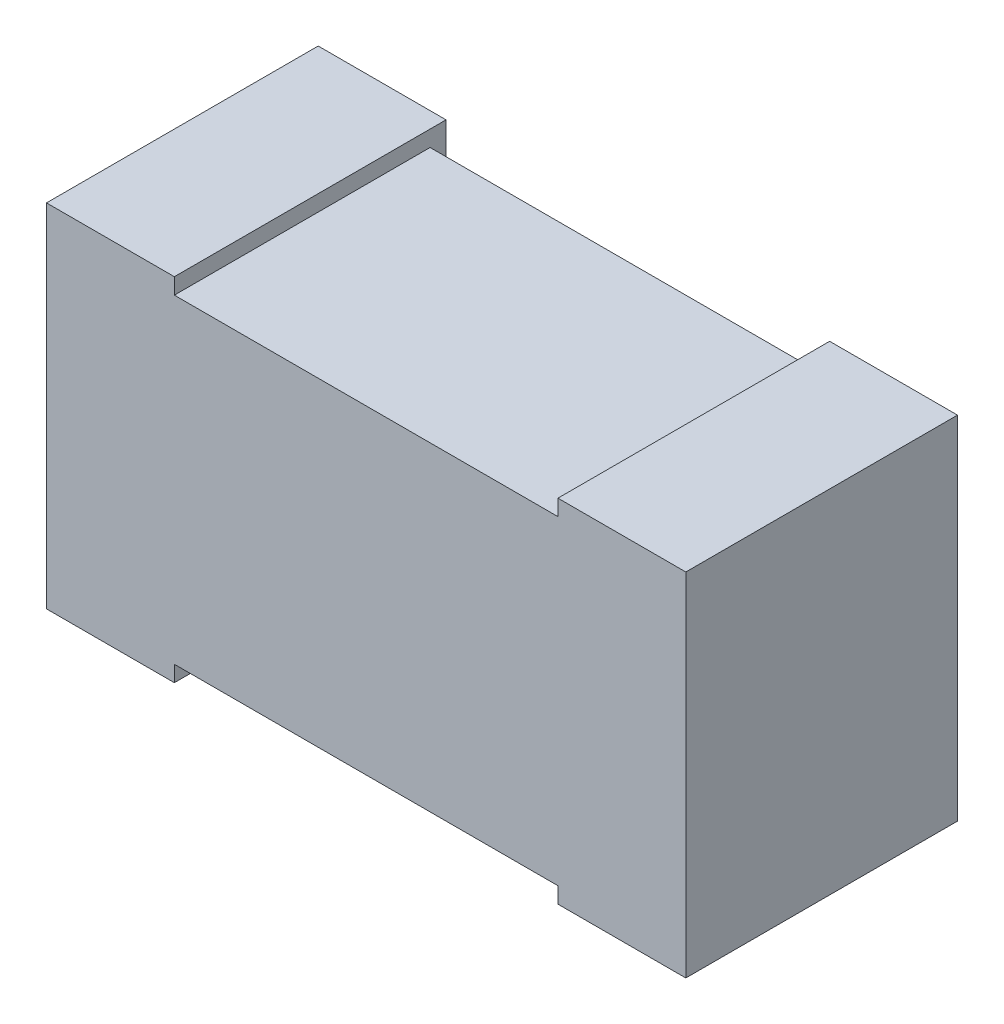
ISO-10303-21;
HEADER;
FILE_DESCRIPTION(('STEP AP214'),'2;1');
FILE_NAME('part.step','',(''),(''),'','','');
FILE_SCHEMA(('AUTOMOTIVE_DESIGN { 1 0 10303 214 1 1 1 1 }'));
ENDSEC;
DATA;
#1=APPLICATION_CONTEXT('core data for automotive mechanical design processes');
#2=APPLICATION_PROTOCOL_DEFINITION('international standard','automotive_design',2000,#1);
#3=PRODUCT_CONTEXT('',#1,'mechanical');
#4=PRODUCT('Part','Part','',(#3));
#5=PRODUCT_RELATED_PRODUCT_CATEGORY('part','',(#4));
#6=PRODUCT_DEFINITION_FORMATION('','',#4);
#7=PRODUCT_DEFINITION_CONTEXT('part definition',#1,'design');
#8=PRODUCT_DEFINITION('design','',#6,#7);
#9=PRODUCT_DEFINITION_SHAPE('','',#8);
#10=(LENGTH_UNIT() NAMED_UNIT(*) SI_UNIT(.MILLI.,.METRE.));
#11=(NAMED_UNIT(*) PLANE_ANGLE_UNIT() SI_UNIT($,.RADIAN.));
#12=(NAMED_UNIT(*) SI_UNIT($,.STERADIAN.) SOLID_ANGLE_UNIT());
#13=UNCERTAINTY_MEASURE_WITH_UNIT(LENGTH_MEASURE(1.E-05),#10,'distance_accuracy_value','');
#14=(GEOMETRIC_REPRESENTATION_CONTEXT(3) GLOBAL_UNCERTAINTY_ASSIGNED_CONTEXT((#13)) GLOBAL_UNIT_ASSIGNED_CONTEXT((#10,
#11,#12)) REPRESENTATION_CONTEXT('',''));
#15=CARTESIAN_POINT('',(0.,0.,0.));
#16=DIRECTION('',(0.,0.,1.));
#17=DIRECTION('',(1.,0.,0.));
#18=AXIS2_PLACEMENT_3D('',#15,#16,#17);
#19=CARTESIAN_POINT('',(7.999,-2.551,-7.85));
#20=DIRECTION('',(0.,0.,-1.));
#21=DIRECTION('',(0.,1.,0.));
#22=AXIS2_PLACEMENT_3D('',#19,#20,#21);
#23=PLANE('',#22);
#24=DIRECTION('',(1.,0.,0.));
#25=VECTOR('',#24,1.);
#26=CARTESIAN_POINT('',(8.2,-2.55,-7.85));
#27=LINE('',#26,#25);
#28=CARTESIAN_POINT('',(8.,-2.55,-7.85));
#29=VERTEX_POINT('',#28);
#30=CARTESIAN_POINT('',(8.4,-2.55,-7.85));
#31=VERTEX_POINT('',#30);
#32=EDGE_CURVE('E110',#29,#31,#27,.T.);
#33=ORIENTED_EDGE('',*,*,#32,.F.);
#34=DIRECTION('',(0.,-1.,0.));
#35=VECTOR('',#34,1.);
#36=CARTESIAN_POINT('',(8.,-2.,-7.85));
#37=LINE('',#36,#35);
#38=CARTESIAN_POINT('',(8.,-1.45,-7.85));
#39=VERTEX_POINT('',#38);
#40=EDGE_CURVE('E104',#39,#29,#37,.T.);
#41=ORIENTED_EDGE('',*,*,#40,.F.);
#42=DIRECTION('',(-1.,0.,0.));
#43=VECTOR('',#42,1.);
#44=CARTESIAN_POINT('',(8.2,-1.45,-7.85));
#45=LINE('',#44,#43);
#46=CARTESIAN_POINT('',(8.4,-1.45,-7.85));
#47=VERTEX_POINT('',#46);
#48=EDGE_CURVE('E21',#47,#39,#45,.T.);
#49=ORIENTED_EDGE('',*,*,#48,.F.);
#50=DIRECTION('',(0.,1.,0.));
#51=VECTOR('',#50,1.);
#52=CARTESIAN_POINT('',(8.4,-2.,-7.85));
#53=LINE('',#52,#51);
#54=EDGE_CURVE('E131',#31,#47,#53,.T.);
#55=ORIENTED_EDGE('',*,*,#54,.F.);
#56=EDGE_LOOP('',(#33,#41,#49,#55));
#57=FACE_BOUND('',#56,.T.);
#58=ADVANCED_FACE('F17',(#57),#23,.T.);
#59=CARTESIAN_POINT('',(7.999,-1.45,-6.999));
#60=DIRECTION('',(0.,1.,0.));
#61=DIRECTION('',(1.,0.,0.));
#62=AXIS2_PLACEMENT_3D('',#59,#60,#61);
#63=PLANE('',#62);
#64=DIRECTION('',(0.,0.,1.));
#65=VECTOR('',#64,1.);
#66=CARTESIAN_POINT('',(8.4,-1.45,-7.425));
#67=LINE('',#66,#65);
#68=CARTESIAN_POINT('',(8.4,-1.45,-7.));
#69=VERTEX_POINT('',#68);
#70=EDGE_CURVE('E117',#47,#69,#67,.T.);
#71=ORIENTED_EDGE('',*,*,#70,.F.);
#72=ORIENTED_EDGE('',*,*,#48,.T.);
#73=DIRECTION('',(0.,0.,-1.));
#74=VECTOR('',#73,1.);
#75=CARTESIAN_POINT('',(8.,-1.45,-7.425));
#76=LINE('',#75,#74);
#77=CARTESIAN_POINT('',(8.,-1.45,-7.));
#78=VERTEX_POINT('',#77);
#79=EDGE_CURVE('E112',#78,#39,#76,.T.);
#80=ORIENTED_EDGE('',*,*,#79,.F.);
#81=DIRECTION('',(-1.,0.,0.));
#82=VECTOR('',#81,1.);
#83=CARTESIAN_POINT('',(9.,-1.45,-7.));
#84=LINE('',#83,#82);
#85=EDGE_CURVE('E155',#69,#78,#84,.T.);
#86=ORIENTED_EDGE('',*,*,#85,.F.);
#87=EDGE_LOOP('',(#71,#72,#80,#86));
#88=FACE_BOUND('',#87,.T.);
#89=ADVANCED_FACE('F114',(#88),#63,.T.);
#90=CARTESIAN_POINT('',(8.,-2.551,-6.999));
#91=DIRECTION('',(-1.,0.,0.));
#92=DIRECTION('',(0.,1.,0.));
#93=AXIS2_PLACEMENT_3D('',#90,#91,#92);
#94=PLANE('',#93);
#95=DIRECTION('',(0.,-1.,0.));
#96=VECTOR('',#95,1.);
#97=CARTESIAN_POINT('',(8.,-2.,-7.));
#98=LINE('',#97,#96);
#99=CARTESIAN_POINT('',(8.,-2.55,-7.));
#100=VERTEX_POINT('',#99);
#101=EDGE_CURVE('E121',#78,#100,#98,.T.);
#102=ORIENTED_EDGE('',*,*,#101,.F.);
#103=ORIENTED_EDGE('',*,*,#79,.T.);
#104=ORIENTED_EDGE('',*,*,#40,.T.);
#105=DIRECTION('',(0.,0.,-1.));
#106=VECTOR('',#105,1.);
#107=CARTESIAN_POINT('',(8.,-2.55,-7.425));
#108=LINE('',#107,#106);
#109=EDGE_CURVE('E123',#100,#29,#108,.T.);
#110=ORIENTED_EDGE('',*,*,#109,.F.);
#111=EDGE_LOOP('',(#102,#103,#104,#110));
#112=FACE_BOUND('',#111,.T.);
#113=ADVANCED_FACE('F119',(#112),#94,.T.);
#114=CARTESIAN_POINT('',(8.401,-2.55,-6.999));
#115=DIRECTION('',(0.,-1.,0.));
#116=DIRECTION('',(-1.,0.,0.));
#117=AXIS2_PLACEMENT_3D('',#114,#115,#116);
#118=PLANE('',#117);
#119=ORIENTED_EDGE('',*,*,#109,.T.);
#120=ORIENTED_EDGE('',*,*,#32,.T.);
#121=DIRECTION('',(0.,0.,-1.));
#122=VECTOR('',#121,1.);
#123=CARTESIAN_POINT('',(8.4,-2.55,-7.425));
#124=LINE('',#123,#122);
#125=CARTESIAN_POINT('',(8.4,-2.55,-7.));
#126=VERTEX_POINT('',#125);
#127=EDGE_CURVE('E128',#126,#31,#124,.T.);
#128=ORIENTED_EDGE('',*,*,#127,.F.);
#129=DIRECTION('',(1.,0.,0.));
#130=VECTOR('',#129,1.);
#131=CARTESIAN_POINT('',(9.,-2.55,-7.));
#132=LINE('',#131,#130);
#133=EDGE_CURVE('E158',#100,#126,#132,.T.);
#134=ORIENTED_EDGE('',*,*,#133,.F.);
#135=EDGE_LOOP('',(#119,#120,#128,#134));
#136=FACE_BOUND('',#135,.T.);
#137=ADVANCED_FACE('F228',(#136),#118,.T.);
#138=CARTESIAN_POINT('',(8.4,-1.449,-6.999));
#139=DIRECTION('',(1.,0.,0.));
#140=DIRECTION('',(0.,-1.,0.));
#141=AXIS2_PLACEMENT_3D('',#138,#139,#140);
#142=PLANE('',#141);
#143=ORIENTED_EDGE('',*,*,#70,.T.);
#144=DIRECTION('',(0.,1.,0.));
#145=VECTOR('',#144,1.);
#146=CARTESIAN_POINT('',(8.4,-2.,-7.));
#147=LINE('',#146,#145);
#148=CARTESIAN_POINT('',(8.4,-1.5,-7.));
#149=VERTEX_POINT('',#148);
#150=EDGE_CURVE('E152',#149,#69,#147,.T.);
#151=ORIENTED_EDGE('',*,*,#150,.F.);
#152=DIRECTION('',(0.,0.,1.));
#153=VECTOR('',#152,1.);
#154=CARTESIAN_POINT('',(8.4,-1.5,-7.4));
#155=LINE('',#154,#153);
#156=CARTESIAN_POINT('',(8.4,-1.5,-7.8));
#157=VERTEX_POINT('',#156);
#158=EDGE_CURVE('E142',#157,#149,#155,.T.);
#159=ORIENTED_EDGE('',*,*,#158,.F.);
#160=DIRECTION('',(0.,1.,0.));
#161=VECTOR('',#160,1.);
#162=CARTESIAN_POINT('',(8.4,-2.,-7.8));
#163=LINE('',#162,#161);
#164=CARTESIAN_POINT('',(8.4,-2.5,-7.8));
#165=VERTEX_POINT('',#164);
#166=EDGE_CURVE('E139',#165,#157,#163,.T.);
#167=ORIENTED_EDGE('',*,*,#166,.F.);
#168=DIRECTION('',(0.,0.,-1.));
#169=VECTOR('',#168,1.);
#170=CARTESIAN_POINT('',(8.4,-2.5,-7.4));
#171=LINE('',#170,#169);
#172=CARTESIAN_POINT('',(8.4,-2.5,-7.));
#173=VERTEX_POINT('',#172);
#174=EDGE_CURVE('E134',#173,#165,#171,.T.);
#175=ORIENTED_EDGE('',*,*,#174,.F.);
#176=DIRECTION('',(0.,1.,0.));
#177=VECTOR('',#176,1.);
#178=CARTESIAN_POINT('',(8.4,-2.,-7.));
#179=LINE('',#178,#177);
#180=EDGE_CURVE('E161',#126,#173,#179,.T.);
#181=ORIENTED_EDGE('',*,*,#180,.F.);
#182=ORIENTED_EDGE('',*,*,#127,.T.);
#183=ORIENTED_EDGE('',*,*,#54,.T.);
#184=EDGE_LOOP('',(#143,#151,#159,#167,#175,#181,#182,#183));
#185=FACE_BOUND('',#184,.T.);
#186=ADVANCED_FACE('F224',(#185),#142,.T.);
#187=CARTESIAN_POINT('',(9.601,-2.5,-6.999));
#188=DIRECTION('',(0.,-1.,0.));
#189=DIRECTION('',(-1.,0.,0.));
#190=AXIS2_PLACEMENT_3D('',#187,#188,#189);
#191=PLANE('',#190);
#192=ORIENTED_EDGE('',*,*,#174,.T.);
#193=DIRECTION('',(-1.,0.,0.));
#194=VECTOR('',#193,1.);
#195=CARTESIAN_POINT('',(9.,-2.5,-7.8));
#196=LINE('',#195,#194);
#197=CARTESIAN_POINT('',(9.6,-2.5,-7.8));
#198=VERTEX_POINT('',#197);
#199=EDGE_CURVE('E136',#198,#165,#196,.T.);
#200=ORIENTED_EDGE('',*,*,#199,.F.);
#201=DIRECTION('',(0.,0.,-1.));
#202=VECTOR('',#201,1.);
#203=CARTESIAN_POINT('',(9.6,-2.5,-7.425));
#204=LINE('',#203,#202);
#205=CARTESIAN_POINT('',(9.6,-2.5,-7.));
#206=VERTEX_POINT('',#205);
#207=EDGE_CURVE('E169',#206,#198,#204,.T.);
#208=ORIENTED_EDGE('',*,*,#207,.F.);
#209=DIRECTION('',(1.,0.,0.));
#210=VECTOR('',#209,1.);
#211=CARTESIAN_POINT('',(9.,-2.5,-7.));
#212=LINE('',#211,#210);
#213=EDGE_CURVE('E147',#173,#206,#212,.T.);
#214=ORIENTED_EDGE('',*,*,#213,.F.);
#215=EDGE_LOOP('',(#192,#200,#208,#214));
#216=FACE_BOUND('',#215,.T.);
#217=ADVANCED_FACE('F232',(#216),#191,.T.);
#218=CARTESIAN_POINT('',(8.399,-2.501,-7.8));
#219=DIRECTION('',(0.,0.,-1.));
#220=DIRECTION('',(0.,1.,0.));
#221=AXIS2_PLACEMENT_3D('',#218,#219,#220);
#222=PLANE('',#221);
#223=ORIENTED_EDGE('',*,*,#199,.T.);
#224=ORIENTED_EDGE('',*,*,#166,.T.);
#225=DIRECTION('',(-1.,0.,0.));
#226=VECTOR('',#225,1.);
#227=CARTESIAN_POINT('',(9.,-1.5,-7.8));
#228=LINE('',#227,#226);
#229=CARTESIAN_POINT('',(9.6,-1.5,-7.8));
#230=VERTEX_POINT('',#229);
#231=EDGE_CURVE('E144',#230,#157,#228,.T.);
#232=ORIENTED_EDGE('',*,*,#231,.F.);
#233=DIRECTION('',(0.,1.,0.));
#234=VECTOR('',#233,1.);
#235=CARTESIAN_POINT('',(9.6,-2.,-7.8));
#236=LINE('',#235,#234);
#237=EDGE_CURVE('E172',#198,#230,#236,.T.);
#238=ORIENTED_EDGE('',*,*,#237,.F.);
#239=EDGE_LOOP('',(#223,#224,#232,#238));
#240=FACE_BOUND('',#239,.T.);
#241=ADVANCED_FACE('F235',(#240),#222,.T.);
#242=CARTESIAN_POINT('',(8.399,-1.5,-6.999));
#243=DIRECTION('',(0.,1.,0.));
#244=DIRECTION('',(1.,0.,0.));
#245=AXIS2_PLACEMENT_3D('',#242,#243,#244);
#246=PLANE('',#245);
#247=DIRECTION('',(0.,0.,1.));
#248=VECTOR('',#247,1.);
#249=CARTESIAN_POINT('',(9.6,-1.5,-7.425));
#250=LINE('',#249,#248);
#251=CARTESIAN_POINT('',(9.6,-1.5,-7.));
#252=VERTEX_POINT('',#251);
#253=EDGE_CURVE('E175',#230,#252,#250,.T.);
#254=ORIENTED_EDGE('',*,*,#253,.F.);
#255=ORIENTED_EDGE('',*,*,#231,.T.);
#256=ORIENTED_EDGE('',*,*,#158,.T.);
#257=DIRECTION('',(-1.,0.,0.));
#258=VECTOR('',#257,1.);
#259=CARTESIAN_POINT('',(9.,-1.5,-7.));
#260=LINE('',#259,#258);
#261=EDGE_CURVE('E149',#252,#149,#260,.T.);
#262=ORIENTED_EDGE('',*,*,#261,.F.);
#263=EDGE_LOOP('',(#254,#255,#256,#262));
#264=FACE_BOUND('',#263,.T.);
#265=ADVANCED_FACE('F221',(#264),#246,.T.);
#266=CARTESIAN_POINT('',(7.999,-1.449,-7.));
#267=DIRECTION('',(0.,0.,1.));
#268=DIRECTION('',(0.,-1.,0.));
#269=AXIS2_PLACEMENT_3D('',#266,#267,#268);
#270=PLANE('',#269);
#271=ORIENTED_EDGE('',*,*,#133,.T.);
#272=ORIENTED_EDGE('',*,*,#180,.T.);
#273=ORIENTED_EDGE('',*,*,#213,.T.);
#274=DIRECTION('',(0.,1.,0.));
#275=VECTOR('',#274,1.);
#276=CARTESIAN_POINT('',(9.6,-2.,-7.));
#277=LINE('',#276,#275);
#278=CARTESIAN_POINT('',(9.6,-2.55,-7.));
#279=VERTEX_POINT('',#278);
#280=EDGE_CURVE('E166',#279,#206,#277,.T.);
#281=ORIENTED_EDGE('',*,*,#280,.F.);
#282=DIRECTION('',(-1.,0.,0.));
#283=VECTOR('',#282,1.);
#284=CARTESIAN_POINT('',(9.8,-2.55,-7.));
#285=LINE('',#284,#283);
#286=CARTESIAN_POINT('',(10.,-2.55,-7.));
#287=VERTEX_POINT('',#286);
#288=EDGE_CURVE('E192',#287,#279,#285,.T.);
#289=ORIENTED_EDGE('',*,*,#288,.F.);
#290=DIRECTION('',(0.,-1.,0.));
#291=VECTOR('',#290,1.);
#292=CARTESIAN_POINT('',(10.,-2.,-7.));
#293=LINE('',#292,#291);
#294=CARTESIAN_POINT('',(10.,-1.45,-7.));
#295=VERTEX_POINT('',#294);
#296=EDGE_CURVE('E186',#295,#287,#293,.T.);
#297=ORIENTED_EDGE('',*,*,#296,.F.);
#298=DIRECTION('',(1.,0.,0.));
#299=VECTOR('',#298,1.);
#300=CARTESIAN_POINT('',(9.8,-1.45,-7.));
#301=LINE('',#300,#299);
#302=CARTESIAN_POINT('',(9.6,-1.45,-7.));
#303=VERTEX_POINT('',#302);
#304=EDGE_CURVE('E181',#303,#295,#301,.T.);
#305=ORIENTED_EDGE('',*,*,#304,.F.);
#306=DIRECTION('',(0.,1.,0.));
#307=VECTOR('',#306,1.);
#308=CARTESIAN_POINT('',(9.6,-2.,-7.));
#309=LINE('',#308,#307);
#310=EDGE_CURVE('E164',#252,#303,#309,.T.);
#311=ORIENTED_EDGE('',*,*,#310,.F.);
#312=ORIENTED_EDGE('',*,*,#261,.T.);
#313=ORIENTED_EDGE('',*,*,#150,.T.);
#314=ORIENTED_EDGE('',*,*,#85,.T.);
#315=ORIENTED_EDGE('',*,*,#101,.T.);
#316=EDGE_LOOP('',(#271,#272,#273,#281,#289,#297,#305,#311,#312,#313,#314,#315));
#317=FACE_BOUND('',#316,.T.);
#318=ADVANCED_FACE('F212',(#317),#270,.T.);
#319=CARTESIAN_POINT('',(9.6,-2.551,-6.999));
#320=DIRECTION('',(-1.,0.,0.));
#321=DIRECTION('',(0.,1.,0.));
#322=AXIS2_PLACEMENT_3D('',#319,#320,#321);
#323=PLANE('',#322);
#324=ORIENTED_EDGE('',*,*,#237,.T.);
#325=ORIENTED_EDGE('',*,*,#253,.T.);
#326=ORIENTED_EDGE('',*,*,#310,.T.);
#327=DIRECTION('',(0.,0.,1.));
#328=VECTOR('',#327,1.);
#329=CARTESIAN_POINT('',(9.6,-1.45,-7.425));
#330=LINE('',#329,#328);
#331=CARTESIAN_POINT('',(9.6,-1.45,-7.85));
#332=VERTEX_POINT('',#331);
#333=EDGE_CURVE('E178',#332,#303,#330,.T.);
#334=ORIENTED_EDGE('',*,*,#333,.F.);
#335=DIRECTION('',(0.,1.,0.));
#336=VECTOR('',#335,1.);
#337=CARTESIAN_POINT('',(9.6,-2.,-7.85));
#338=LINE('',#337,#336);
#339=CARTESIAN_POINT('',(9.6,-2.55,-7.85));
#340=VERTEX_POINT('',#339);
#341=EDGE_CURVE('E195',#340,#332,#338,.T.);
#342=ORIENTED_EDGE('',*,*,#341,.F.);
#343=DIRECTION('',(0.,0.,-1.));
#344=VECTOR('',#343,1.);
#345=CARTESIAN_POINT('',(9.6,-2.55,-7.425));
#346=LINE('',#345,#344);
#347=EDGE_CURVE('E188',#279,#340,#346,.T.);
#348=ORIENTED_EDGE('',*,*,#347,.F.);
#349=ORIENTED_EDGE('',*,*,#280,.T.);
#350=ORIENTED_EDGE('',*,*,#207,.T.);
#351=EDGE_LOOP('',(#324,#325,#326,#334,#342,#348,#349,#350));
#352=FACE_BOUND('',#351,.T.);
#353=ADVANCED_FACE('F217',(#352),#323,.T.);
#354=CARTESIAN_POINT('',(9.599,-1.45,-6.999));
#355=DIRECTION('',(0.,1.,0.));
#356=DIRECTION('',(1.,0.,0.));
#357=AXIS2_PLACEMENT_3D('',#354,#355,#356);
#358=PLANE('',#357);
#359=DIRECTION('',(0.,0.,1.));
#360=VECTOR('',#359,1.);
#361=CARTESIAN_POINT('',(10.,-1.45,-7.425));
#362=LINE('',#361,#360);
#363=CARTESIAN_POINT('',(10.,-1.45,-7.85));
#364=VERTEX_POINT('',#363);
#365=EDGE_CURVE('E183',#364,#295,#362,.T.);
#366=ORIENTED_EDGE('',*,*,#365,.F.);
#367=DIRECTION('',(1.,0.,0.));
#368=VECTOR('',#367,1.);
#369=CARTESIAN_POINT('',(9.8,-1.45,-7.85));
#370=LINE('',#369,#368);
#371=EDGE_CURVE('E198',#332,#364,#370,.T.);
#372=ORIENTED_EDGE('',*,*,#371,.F.);
#373=ORIENTED_EDGE('',*,*,#333,.T.);
#374=ORIENTED_EDGE('',*,*,#304,.T.);
#375=EDGE_LOOP('',(#366,#372,#373,#374));
#376=FACE_BOUND('',#375,.T.);
#377=ADVANCED_FACE('F208',(#376),#358,.T.);
#378=CARTESIAN_POINT('',(10.,-1.449,-6.999));
#379=DIRECTION('',(1.,0.,0.));
#380=DIRECTION('',(0.,-1.,0.));
#381=AXIS2_PLACEMENT_3D('',#378,#379,#380);
#382=PLANE('',#381);
#383=DIRECTION('',(0.,0.,1.));
#384=VECTOR('',#383,1.);
#385=CARTESIAN_POINT('',(10.,-2.55,-7.425));
#386=LINE('',#385,#384);
#387=CARTESIAN_POINT('',(10.,-2.55,-7.85));
#388=VERTEX_POINT('',#387);
#389=EDGE_CURVE('E36',#388,#287,#386,.T.);
#390=ORIENTED_EDGE('',*,*,#389,.F.);
#391=DIRECTION('',(0.,-1.,0.));
#392=VECTOR('',#391,1.);
#393=CARTESIAN_POINT('',(10.,-2.,-7.85));
#394=LINE('',#393,#392);
#395=EDGE_CURVE('E27',#364,#388,#394,.T.);
#396=ORIENTED_EDGE('',*,*,#395,.F.);
#397=ORIENTED_EDGE('',*,*,#365,.T.);
#398=ORIENTED_EDGE('',*,*,#296,.T.);
#399=EDGE_LOOP('',(#390,#396,#397,#398));
#400=FACE_BOUND('',#399,.T.);
#401=ADVANCED_FACE('F204',(#400),#382,.T.);
#402=CARTESIAN_POINT('',(10.001,-2.55,-6.999));
#403=DIRECTION('',(0.,-1.,0.));
#404=DIRECTION('',(-1.,0.,0.));
#405=AXIS2_PLACEMENT_3D('',#402,#403,#404);
#406=PLANE('',#405);
#407=ORIENTED_EDGE('',*,*,#389,.T.);
#408=ORIENTED_EDGE('',*,*,#288,.T.);
#409=ORIENTED_EDGE('',*,*,#347,.T.);
#410=DIRECTION('',(-1.,0.,0.));
#411=VECTOR('',#410,1.);
#412=CARTESIAN_POINT('',(9.8,-2.55,-7.85));
#413=LINE('',#412,#411);
#414=EDGE_CURVE('E11',#388,#340,#413,.T.);
#415=ORIENTED_EDGE('',*,*,#414,.F.);
#416=EDGE_LOOP('',(#407,#408,#409,#415));
#417=FACE_BOUND('',#416,.T.);
#418=ADVANCED_FACE('F215',(#417),#406,.T.);
#419=CARTESIAN_POINT('',(9.599,-2.551,-7.85));
#420=DIRECTION('',(0.,0.,-1.));
#421=DIRECTION('',(0.,1.,0.));
#422=AXIS2_PLACEMENT_3D('',#419,#420,#421);
#423=PLANE('',#422);
#424=ORIENTED_EDGE('',*,*,#395,.T.);
#425=ORIENTED_EDGE('',*,*,#414,.T.);
#426=ORIENTED_EDGE('',*,*,#341,.T.);
#427=ORIENTED_EDGE('',*,*,#371,.T.);
#428=EDGE_LOOP('',(#424,#425,#426,#427));
#429=FACE_BOUND('',#428,.T.);
#430=ADVANCED_FACE('F19',(#429),#423,.T.);
#431=CLOSED_SHELL('',(#58,#89,#113,#137,#186,#217,#241,#265,#318,#353,#377,#401,#418,#430));
#432=MANIFOLD_SOLID_BREP('B1',#431);
#433=ADVANCED_BREP_SHAPE_REPRESENTATION('',(#18,#432),#14);
#434=SHAPE_DEFINITION_REPRESENTATION(#9,#433);
ENDSEC;
END-ISO-10303-21;
